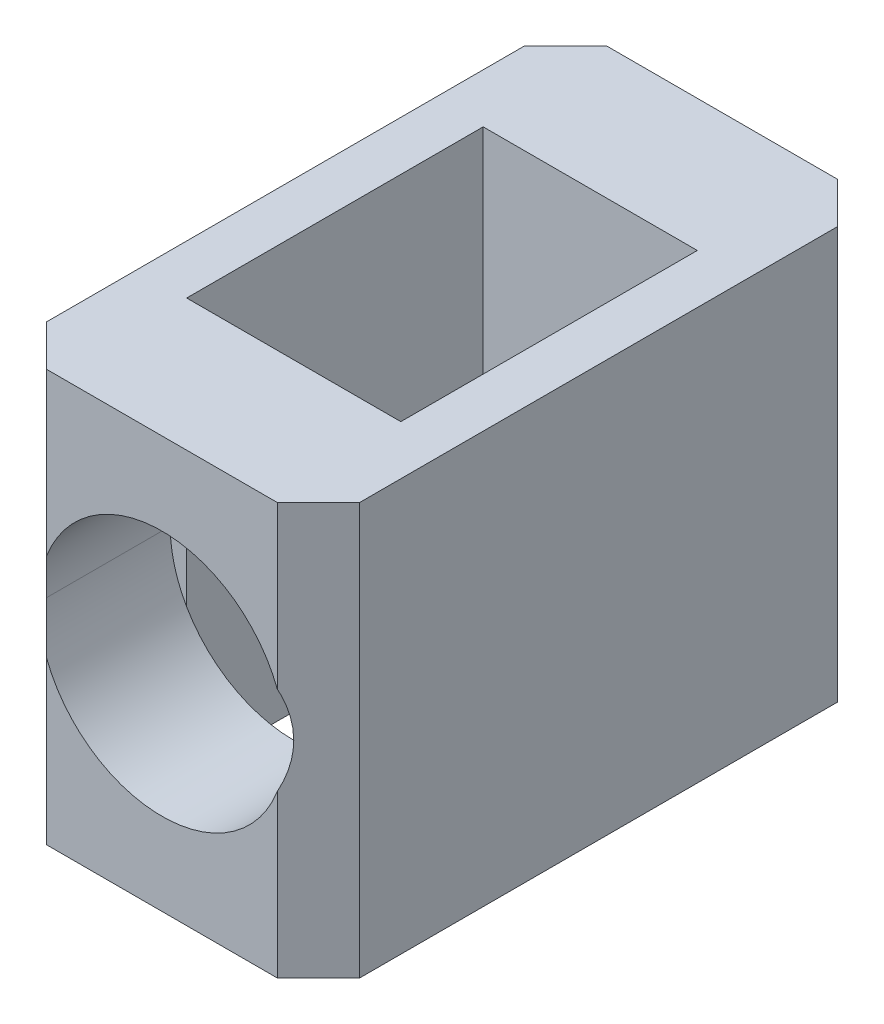
ISO-10303-21;
HEADER;
FILE_DESCRIPTION(('STEP AP214'),'2;1');
FILE_NAME('part.step','',(''),(''),'','','');
FILE_SCHEMA(('AUTOMOTIVE_DESIGN { 1 0 10303 214 1 1 1 1 }'));
ENDSEC;
DATA;
#1=APPLICATION_CONTEXT('core data for automotive mechanical design processes');
#2=APPLICATION_PROTOCOL_DEFINITION('international standard','automotive_design',2000,#1);
#3=PRODUCT_CONTEXT('',#1,'mechanical');
#4=PRODUCT('Part','Part','',(#3));
#5=PRODUCT_RELATED_PRODUCT_CATEGORY('part','',(#4));
#6=PRODUCT_DEFINITION_FORMATION('','',#4);
#7=PRODUCT_DEFINITION_CONTEXT('part definition',#1,'design');
#8=PRODUCT_DEFINITION('design','',#6,#7);
#9=PRODUCT_DEFINITION_SHAPE('','',#8);
#10=(LENGTH_UNIT() NAMED_UNIT(*) SI_UNIT(.MILLI.,.METRE.));
#11=(NAMED_UNIT(*) PLANE_ANGLE_UNIT() SI_UNIT($,.RADIAN.));
#12=(NAMED_UNIT(*) SI_UNIT($,.STERADIAN.) SOLID_ANGLE_UNIT());
#13=UNCERTAINTY_MEASURE_WITH_UNIT(LENGTH_MEASURE(1.E-05),#10,'distance_accuracy_value','');
#14=(GEOMETRIC_REPRESENTATION_CONTEXT(3) GLOBAL_UNCERTAINTY_ASSIGNED_CONTEXT((#13)) GLOBAL_UNIT_ASSIGNED_CONTEXT((#10,
#11,#12)) REPRESENTATION_CONTEXT('',''));
#15=CARTESIAN_POINT('',(0.,0.,0.));
#16=DIRECTION('',(0.,0.,1.));
#17=DIRECTION('',(1.,0.,0.));
#18=AXIS2_PLACEMENT_3D('',#15,#16,#17);
#19=CARTESIAN_POINT('',(7.61999999999975,5.27000000000021,8.43));
#20=DIRECTION('',(0.,0.,-1.));
#21=DIRECTION('',(-1.,0.,0.));
#22=AXIS2_PLACEMENT_3D('',#19,#20,#21);
#23=CYLINDRICAL_SURFACE('',#22,1.5);
#24=DIRECTION('',(0.,0.,1.));
#25=VECTOR('',#24,1.);
#26=CARTESIAN_POINT('',(6.12000000000035,5.26999999999963,8.43));
#27=LINE('',#26,#25);
#28=CARTESIAN_POINT('',(6.12000000000032,5.26999999999963,6.83));
#29=VERTEX_POINT('',#28);
#30=CARTESIAN_POINT('',(6.12000000000032,5.26999999999963,8.33));
#31=VERTEX_POINT('',#30);
#32=EDGE_CURVE('E264',#29,#31,#27,.T.);
#33=ORIENTED_EDGE('',*,*,#32,.F.);
#34=CARTESIAN_POINT('',(7.61999999999972,5.27000000000021,6.82999999999992));
#35=DIRECTION('',(0.,0.,1.));
#36=DIRECTION('',(-1.,0.,0.));
#37=AXIS2_PLACEMENT_3D('',#34,#35,#36);
#38=CIRCLE('',#37,1.5);
#39=CARTESIAN_POINT('',(6.32,6.01833147735468,6.83));
#40=VERTEX_POINT('',#39);
#41=EDGE_CURVE('E28',#40,#29,#38,.T.);
#42=ORIENTED_EDGE('',*,*,#41,.F.);
#43=CARTESIAN_POINT('',(7.61999999999972,5.27000000000021,6.83));
#44=DIRECTION('',(0.,0.,1.));
#45=DIRECTION('',(-1.,0.,0.));
#46=AXIS2_PLACEMENT_3D('',#43,#44,#45);
#47=CIRCLE('',#46,1.5);
#48=CARTESIAN_POINT('',(8.92,6.01833147735475,6.82999999999989));
#49=VERTEX_POINT('',#48);
#50=EDGE_CURVE('E347',#49,#40,#47,.T.);
#51=ORIENTED_EDGE('',*,*,#50,.F.);
#52=CARTESIAN_POINT('',(7.61999999999972,5.27000000000021,6.82999999999992));
#53=DIRECTION('',(0.,0.,1.));
#54=DIRECTION('',(-1.,0.,0.));
#55=AXIS2_PLACEMENT_3D('',#52,#53,#54);
#56=CIRCLE('',#55,1.5);
#57=CARTESIAN_POINT('',(9.11999999999983,5.27000000000007,6.82999999999989));
#58=VERTEX_POINT('',#57);
#59=EDGE_CURVE('E11',#58,#49,#56,.T.);
#60=ORIENTED_EDGE('',*,*,#59,.F.);
#61=DIRECTION('',(0.,0.,1.));
#62=VECTOR('',#61,1.);
#63=CARTESIAN_POINT('',(9.11999999999986,5.27000000000007,8.43));
#64=LINE('',#63,#62);
#65=CARTESIAN_POINT('',(9.11999999999983,5.27000000000007,8.32999999999989));
#66=VERTEX_POINT('',#65);
#67=EDGE_CURVE('E266',#58,#66,#64,.T.);
#68=ORIENTED_EDGE('',*,*,#67,.T.);
#69=CARTESIAN_POINT('',(7.61999999999975,5.27000000000021,9.83));
#70=DIRECTION('',(0.707106781186561,0.,0.707106781186534));
#71=DIRECTION('',(-0.707106781186534,0.,0.707106781186561));
#72=AXIS2_PLACEMENT_3D('',#69,#70,#71);
#73=ELLIPSE('',#72,2.12132034355964,1.5);
#74=CARTESIAN_POINT('',(9.01999999999981,5.80851648071365,8.43));
#75=VERTEX_POINT('',#74);
#76=EDGE_CURVE('E378',#66,#75,#73,.T.);
#77=ORIENTED_EDGE('',*,*,#76,.T.);
#78=CARTESIAN_POINT('',(7.61999999999975,5.27000000000021,8.43));
#79=DIRECTION('',(0.,0.,1.));
#80=DIRECTION('',(-1.,0.,0.));
#81=AXIS2_PLACEMENT_3D('',#78,#79,#80);
#82=CIRCLE('',#81,1.5);
#83=CARTESIAN_POINT('',(6.21999999999991,5.80851648071329,8.43));
#84=VERTEX_POINT('',#83);
#85=EDGE_CURVE('E351',#75,#84,#82,.T.);
#86=ORIENTED_EDGE('',*,*,#85,.T.);
#87=CARTESIAN_POINT('',(7.61999999999975,5.27000000000021,9.83));
#88=DIRECTION('',(-0.707106781186535,0.,0.70710678118656));
#89=DIRECTION('',(0.70710678118656,0.,0.707106781186535));
#90=AXIS2_PLACEMENT_3D('',#87,#88,#89);
#91=ELLIPSE('',#90,2.12132034355964,1.5);
#92=EDGE_CURVE('E269',#84,#31,#91,.T.);
#93=ORIENTED_EDGE('',*,*,#92,.T.);
#94=EDGE_LOOP('',(#33,#42,#51,#60,#68,#77,#86,#93));
#95=FACE_BOUND('',#94,.T.);
#96=ADVANCED_FACE('F17',(#95),#23,.F.);
#97=CARTESIAN_POINT('',(8.94500000000031,5.26999999999963,6.82999999999989));
#98=DIRECTION('',(0.,0.,1.));
#99=DIRECTION('',(1.,0.,0.));
#100=AXIS2_PLACEMENT_3D('',#97,#98,#99);
#101=PLANE('',#100);
#102=DIRECTION('',(0.,-1.,0.));
#103=VECTOR('',#102,1.);
#104=CARTESIAN_POINT('',(8.91999999999985,2.77000000000016,6.82999999999989));
#105=LINE('',#104,#103);
#106=CARTESIAN_POINT('',(8.92,4.52166852264494,6.82999999999989));
#107=VERTEX_POINT('',#106);
#108=EDGE_CURVE('E280',#49,#107,#105,.T.);
#109=ORIENTED_EDGE('',*,*,#108,.T.);
#110=CARTESIAN_POINT('',(7.61999999999972,5.27000000000021,6.82999999999992));
#111=DIRECTION('',(0.,0.,1.));
#112=DIRECTION('',(-1.,0.,0.));
#113=AXIS2_PLACEMENT_3D('',#110,#111,#112);
#114=CIRCLE('',#113,1.5);
#115=EDGE_CURVE('E297',#107,#58,#114,.T.);
#116=ORIENTED_EDGE('',*,*,#115,.T.);
#117=ORIENTED_EDGE('',*,*,#59,.T.);
#118=EDGE_LOOP('',(#109,#116,#117));
#119=FACE_BOUND('',#118,.T.);
#120=ADVANCED_FACE('F462',(#119),#101,.T.);
#121=CARTESIAN_POINT('',(8.94500000000031,5.26999999999963,6.82999999999989));
#122=DIRECTION('',(0.,0.,1.));
#123=DIRECTION('',(1.,0.,0.));
#124=AXIS2_PLACEMENT_3D('',#121,#122,#123);
#125=PLANE('',#124);
#126=CARTESIAN_POINT('',(7.61999999999972,5.27000000000021,6.82999999999992));
#127=DIRECTION('',(0.,0.,1.));
#128=DIRECTION('',(-1.,0.,0.));
#129=AXIS2_PLACEMENT_3D('',#126,#127,#128);
#130=CIRCLE('',#129,1.5);
#131=CARTESIAN_POINT('',(6.32000000000016,4.52166852264501,6.83));
#132=VERTEX_POINT('',#131);
#133=EDGE_CURVE('E267',#29,#132,#130,.T.);
#134=ORIENTED_EDGE('',*,*,#133,.T.);
#135=DIRECTION('',(0.,1.,0.));
#136=VECTOR('',#135,1.);
#137=CARTESIAN_POINT('',(6.31999999999988,2.77000000000016,6.83));
#138=LINE('',#137,#136);
#139=EDGE_CURVE('E352',#132,#40,#138,.T.);
#140=ORIENTED_EDGE('',*,*,#139,.T.);
#141=ORIENTED_EDGE('',*,*,#41,.T.);
#142=EDGE_LOOP('',(#134,#140,#141));
#143=FACE_BOUND('',#142,.T.);
#144=ADVANCED_FACE('F491',(#143),#125,.T.);
#145=CARTESIAN_POINT('',(7.61999999999975,5.27000000000021,8.43));
#146=DIRECTION('',(0.,0.,-1.));
#147=DIRECTION('',(-1.,0.,0.));
#148=AXIS2_PLACEMENT_3D('',#145,#146,#147);
#149=CYLINDRICAL_SURFACE('',#148,1.5);
#150=ORIENTED_EDGE('',*,*,#133,.F.);
#151=ORIENTED_EDGE('',*,*,#32,.T.);
#152=CARTESIAN_POINT('',(7.61999999999975,5.27000000000021,9.83));
#153=DIRECTION('',(-0.707106781186535,0.,0.70710678118656));
#154=DIRECTION('',(0.70710678118656,0.,0.707106781186535));
#155=AXIS2_PLACEMENT_3D('',#152,#153,#154);
#156=ELLIPSE('',#155,2.12132034355964,1.5);
#157=CARTESIAN_POINT('',(6.21999999999977,4.73148351928682,8.43));
#158=VERTEX_POINT('',#157);
#159=EDGE_CURVE('E274',#31,#158,#156,.T.);
#160=ORIENTED_EDGE('',*,*,#159,.T.);
#161=CARTESIAN_POINT('',(7.61999999999975,5.27000000000021,8.43));
#162=DIRECTION('',(0.,0.,1.));
#163=DIRECTION('',(-1.,0.,0.));
#164=AXIS2_PLACEMENT_3D('',#161,#162,#163);
#165=CIRCLE('',#164,1.5);
#166=CARTESIAN_POINT('',(9.02000000000015,4.73148351928624,8.43));
#167=VERTEX_POINT('',#166);
#168=EDGE_CURVE('E289',#158,#167,#165,.T.);
#169=ORIENTED_EDGE('',*,*,#168,.T.);
#170=CARTESIAN_POINT('',(7.61999999999975,5.27000000000021,9.83));
#171=DIRECTION('',(0.707106781186561,0.,0.707106781186534));
#172=DIRECTION('',(-0.707106781186534,0.,0.707106781186561));
#173=AXIS2_PLACEMENT_3D('',#170,#171,#172);
#174=ELLIPSE('',#173,2.12132034355964,1.5);
#175=EDGE_CURVE('E361',#167,#66,#174,.T.);
#176=ORIENTED_EDGE('',*,*,#175,.T.);
#177=ORIENTED_EDGE('',*,*,#67,.F.);
#178=ORIENTED_EDGE('',*,*,#115,.F.);
#179=CARTESIAN_POINT('',(7.61999999999972,5.27000000000021,6.83));
#180=DIRECTION('',(0.,0.,1.));
#181=DIRECTION('',(-1.,0.,0.));
#182=AXIS2_PLACEMENT_3D('',#179,#180,#181);
#183=CIRCLE('',#182,1.5);
#184=EDGE_CURVE('E273',#132,#107,#183,.T.);
#185=ORIENTED_EDGE('',*,*,#184,.F.);
#186=EDGE_LOOP('',(#150,#151,#160,#169,#176,#177,#178,#185));
#187=FACE_BOUND('',#186,.T.);
#188=ADVANCED_FACE('F19',(#187),#149,.F.);
#189=CARTESIAN_POINT('',(8.61999999999958,7.77000000000033,6.83));
#190=DIRECTION('',(0.,0.,1.));
#191=DIRECTION('',(1.,0.,0.));
#192=AXIS2_PLACEMENT_3D('',#189,#190,#191);
#193=PLANE('',#192);
#194=ORIENTED_EDGE('',*,*,#184,.T.);
#195=DIRECTION('',(0.,1.,0.));
#196=VECTOR('',#195,1.);
#197=CARTESIAN_POINT('',(8.91999999999985,2.77000000000016,6.83));
#198=LINE('',#197,#196);
#199=CARTESIAN_POINT('',(8.91999999999985,2.77000000000016,6.83));
#200=VERTEX_POINT('',#199);
#201=EDGE_CURVE('E322',#200,#107,#198,.T.);
#202=ORIENTED_EDGE('',*,*,#201,.F.);
#203=DIRECTION('',(1.,0.,0.));
#204=VECTOR('',#203,1.);
#205=CARTESIAN_POINT('',(65.5310968965142,2.7700000000002,6.82999999999898));
#206=LINE('',#205,#204);
#207=CARTESIAN_POINT('',(6.31999999999988,2.77000000000016,6.83));
#208=VERTEX_POINT('',#207);
#209=EDGE_CURVE('E90',#208,#200,#206,.T.);
#210=ORIENTED_EDGE('',*,*,#209,.F.);
#211=DIRECTION('',(0.,1.,0.));
#212=VECTOR('',#211,1.);
#213=CARTESIAN_POINT('',(6.31999999999988,2.77000000000016,6.83));
#214=LINE('',#213,#212);
#215=EDGE_CURVE('E285',#208,#132,#214,.T.);
#216=ORIENTED_EDGE('',*,*,#215,.T.);
#217=EDGE_LOOP('',(#194,#202,#210,#216));
#218=FACE_BOUND('',#217,.T.);
#219=ADVANCED_FACE('F455',(#218),#193,.F.);
#220=CARTESIAN_POINT('',(5.97000000000028,5.26999999999964,8.18));
#221=DIRECTION('',(-0.707106781186534,0.,0.707106781186561));
#222=DIRECTION('',(0.,1.,0.));
#223=AXIS2_PLACEMENT_3D('',#220,#221,#222);
#224=PLANE('',#223);
#225=DIRECTION('',(0.,1.,0.));
#226=VECTOR('',#225,1.);
#227=CARTESIAN_POINT('',(5.72,5.26999999999984,7.93));
#228=LINE('',#227,#226);
#229=CARTESIAN_POINT('',(5.71999999999977,2.77000000000016,7.93));
#230=VERTEX_POINT('',#229);
#231=CARTESIAN_POINT('',(5.72000000000028,7.76999999999961,7.93));
#232=VERTEX_POINT('',#231);
#233=EDGE_CURVE('E260',#230,#232,#228,.T.);
#234=ORIENTED_EDGE('',*,*,#233,.F.);
#235=DIRECTION('',(-0.70710678118656,0.,-0.707106781186535));
#236=VECTOR('',#235,1.);
#237=CARTESIAN_POINT('',(-57.000076808694,2.76999999999905,-54.7900768086914));
#238=LINE('',#237,#236);
#239=CARTESIAN_POINT('',(6.22000000000034,2.76999999999965,8.43));
#240=VERTEX_POINT('',#239);
#241=EDGE_CURVE('E295',#240,#230,#238,.T.);
#242=ORIENTED_EDGE('',*,*,#241,.F.);
#243=DIRECTION('',(0.,1.,0.));
#244=VECTOR('',#243,1.);
#245=CARTESIAN_POINT('',(6.21999999999983,5.27000000000006,8.43));
#246=LINE('',#245,#244);
#247=EDGE_CURVE('E286',#240,#158,#246,.T.);
#248=ORIENTED_EDGE('',*,*,#247,.T.);
#249=ORIENTED_EDGE('',*,*,#159,.F.);
#250=ORIENTED_EDGE('',*,*,#92,.F.);
#251=DIRECTION('',(0.,1.,0.));
#252=VECTOR('',#251,1.);
#253=CARTESIAN_POINT('',(6.21999999999983,5.27000000000006,8.43));
#254=LINE('',#253,#252);
#255=CARTESIAN_POINT('',(6.22000000000011,7.76999999999983,8.43));
#256=VERTEX_POINT('',#255);
#257=EDGE_CURVE('E376',#84,#256,#254,.T.);
#258=ORIENTED_EDGE('',*,*,#257,.T.);
#259=DIRECTION('',(-0.70710678118656,0.,-0.707106781186535));
#260=VECTOR('',#259,1.);
#261=CARTESIAN_POINT('',(-57.0000768086941,7.76999999999941,-54.7900768086914));
#262=LINE('',#261,#260);
#263=EDGE_CURVE('E314',#256,#232,#262,.T.);
#264=ORIENTED_EDGE('',*,*,#263,.T.);
#265=EDGE_LOOP('',(#234,#242,#248,#249,#250,#258,#264));
#266=FACE_BOUND('',#265,.T.);
#267=ADVANCED_FACE('F415',(#266),#224,.T.);
#268=CARTESIAN_POINT('',(9.26999999999987,5.27,8.18));
#269=DIRECTION('',(0.70710678118656,0.,0.707106781186535));
#270=DIRECTION('',(0.,-1.,0.));
#271=AXIS2_PLACEMENT_3D('',#268,#269,#270);
#272=PLANE('',#271);
#273=DIRECTION('',(0.,-1.,0.));
#274=VECTOR('',#273,1.);
#275=CARTESIAN_POINT('',(9.52000000000015,5.26999999999985,7.93));
#276=LINE('',#275,#274);
#277=CARTESIAN_POINT('',(9.51999999999967,7.77000000000023,7.93));
#278=VERTEX_POINT('',#277);
#279=CARTESIAN_POINT('',(9.51999999999987,2.77000000000009,7.93));
#280=VERTEX_POINT('',#279);
#281=EDGE_CURVE('E216',#278,#280,#276,.T.);
#282=ORIENTED_EDGE('',*,*,#281,.F.);
#283=DIRECTION('',(-0.707106781186534,0.,0.707106781186561));
#284=VECTOR('',#283,1.);
#285=CARTESIAN_POINT('',(72.2400768086914,7.77000000000049,-54.7900768086937));
#286=LINE('',#285,#284);
#287=CARTESIAN_POINT('',(9.01999999999987,7.77,8.43));
#288=VERTEX_POINT('',#287);
#289=EDGE_CURVE('E293',#278,#288,#286,.T.);
#290=ORIENTED_EDGE('',*,*,#289,.T.);
#291=DIRECTION('',(0.,-1.,0.));
#292=VECTOR('',#291,1.);
#293=CARTESIAN_POINT('',(9.02000000000035,5.26999999999964,8.43));
#294=LINE('',#293,#292);
#295=EDGE_CURVE('E372',#288,#75,#294,.T.);
#296=ORIENTED_EDGE('',*,*,#295,.T.);
#297=ORIENTED_EDGE('',*,*,#76,.F.);
#298=ORIENTED_EDGE('',*,*,#175,.F.);
#299=DIRECTION('',(0.,-1.,0.));
#300=VECTOR('',#299,1.);
#301=CARTESIAN_POINT('',(9.02000000000035,5.26999999999964,8.43));
#302=LINE('',#301,#300);
#303=CARTESIAN_POINT('',(9.0200000000001,2.76999999999987,8.43));
#304=VERTEX_POINT('',#303);
#305=EDGE_CURVE('E328',#167,#304,#302,.T.);
#306=ORIENTED_EDGE('',*,*,#305,.T.);
#307=DIRECTION('',(-0.707106781186534,0.,0.707106781186561));
#308=VECTOR('',#307,1.);
#309=CARTESIAN_POINT('',(72.2400768086915,2.77000000000048,-54.7900768086937));
#310=LINE('',#309,#308);
#311=EDGE_CURVE('E184',#280,#304,#310,.T.);
#312=ORIENTED_EDGE('',*,*,#311,.F.);
#313=EDGE_LOOP('',(#282,#290,#296,#297,#298,#306,#312));
#314=FACE_BOUND('',#313,.T.);
#315=ADVANCED_FACE('F432',(#314),#272,.T.);
#316=CARTESIAN_POINT('',(5.97000000000017,5.26999999999964,1.87999999999996));
#317=DIRECTION('',(-0.70710678118656,0.,-0.707106781186535));
#318=DIRECTION('',(-0.707106781186535,0.,0.70710678118656));
#319=AXIS2_PLACEMENT_3D('',#316,#317,#318);
#320=PLANE('',#319);
#321=DIRECTION('',(0.,-1.,0.));
#322=VECTOR('',#321,1.);
#323=CARTESIAN_POINT('',(5.71999999999991,5.26999999999984,2.12999999999996));
#324=LINE('',#323,#322);
#325=CARTESIAN_POINT('',(5.7200000000002,7.76999999999961,2.13000000000006));
#326=VERTEX_POINT('',#325);
#327=CARTESIAN_POINT('',(5.71999999999969,2.77000000000016,2.13000000000006));
#328=VERTEX_POINT('',#327);
#329=EDGE_CURVE('E230',#326,#328,#324,.T.);
#330=ORIENTED_EDGE('',*,*,#329,.F.);
#331=DIRECTION('',(0.707106781186534,0.,-0.707106781186561));
#332=VECTOR('',#331,1.);
#333=CARTESIAN_POINT('',(62.6400768086915,7.77000000000034,-54.7900768086936));
#334=LINE('',#333,#332);
#335=CARTESIAN_POINT('',(6.22,7.76999999999983,1.63000000000004));
#336=VERTEX_POINT('',#335);
#337=EDGE_CURVE('E346',#326,#336,#334,.T.);
#338=ORIENTED_EDGE('',*,*,#337,.T.);
#339=DIRECTION('',(0.,-1.,0.));
#340=VECTOR('',#339,1.);
#341=CARTESIAN_POINT('',(6.21999999999969,5.27000000000006,1.62999999999994));
#342=LINE('',#341,#340);
#343=CARTESIAN_POINT('',(6.2200000000002,2.76999999999965,1.63000000000004));
#344=VERTEX_POINT('',#343);
#345=EDGE_CURVE('E325',#336,#344,#342,.T.);
#346=ORIENTED_EDGE('',*,*,#345,.T.);
#347=DIRECTION('',(0.707106781186534,0.,-0.707106781186561));
#348=VECTOR('',#347,1.);
#349=CARTESIAN_POINT('',(62.6400768086917,2.77000000000019,-54.7900768086936));
#350=LINE('',#349,#348);
#351=EDGE_CURVE('E202',#328,#344,#350,.T.);
#352=ORIENTED_EDGE('',*,*,#351,.F.);
#353=EDGE_LOOP('',(#330,#338,#346,#352));
#354=FACE_BOUND('',#353,.T.);
#355=ADVANCED_FACE('F423',(#354),#320,.T.);
#356=CARTESIAN_POINT('',(9.26999999999975,5.27,1.87999999999989));
#357=DIRECTION('',(0.707106781186535,0.,-0.707106781186561));
#358=DIRECTION('',(0.,-1.,0.));
#359=AXIS2_PLACEMENT_3D('',#356,#357,#358);
#360=PLANE('',#359);
#361=DIRECTION('',(0.,-1.,0.));
#362=VECTOR('',#361,1.);
#363=CARTESIAN_POINT('',(9.02000000000021,5.26999999999964,1.6299999999999));
#364=LINE('',#363,#362);
#365=CARTESIAN_POINT('',(9.01999999999973,7.77,1.63));
#366=VERTEX_POINT('',#365);
#367=CARTESIAN_POINT('',(9.02,2.76999999999987,1.63));
#368=VERTEX_POINT('',#367);
#369=EDGE_CURVE('E308',#366,#368,#364,.T.);
#370=ORIENTED_EDGE('',*,*,#369,.F.);
#371=DIRECTION('',(0.70710678118656,0.,0.707106781186535));
#372=VECTOR('',#371,1.);
#373=CARTESIAN_POINT('',(-47.4000768086939,7.76999999999941,-54.7900768086916));
#374=LINE('',#373,#372);
#375=CARTESIAN_POINT('',(9.51999999999958,7.77000000000023,2.13));
#376=VERTEX_POINT('',#375);
#377=EDGE_CURVE('E208',#366,#376,#374,.T.);
#378=ORIENTED_EDGE('',*,*,#377,.T.);
#379=DIRECTION('',(0.,-1.,0.));
#380=VECTOR('',#379,1.);
#381=CARTESIAN_POINT('',(9.52,5.26999999999985,2.12999999999989));
#382=LINE('',#381,#380);
#383=CARTESIAN_POINT('',(9.51999999999978,2.77000000000009,2.13));
#384=VERTEX_POINT('',#383);
#385=EDGE_CURVE('E205',#376,#384,#382,.T.);
#386=ORIENTED_EDGE('',*,*,#385,.T.);
#387=DIRECTION('',(0.70710678118656,0.,0.707106781186535));
#388=VECTOR('',#387,1.);
#389=CARTESIAN_POINT('',(-47.4000768086939,2.76999999999905,-54.7900768086916));
#390=LINE('',#389,#388);
#391=EDGE_CURVE('E191',#368,#384,#390,.T.);
#392=ORIENTED_EDGE('',*,*,#391,.F.);
#393=EDGE_LOOP('',(#370,#378,#386,#392));
#394=FACE_BOUND('',#393,.T.);
#395=ADVANCED_FACE('F206',(#394),#360,.T.);
#396=CARTESIAN_POINT('',(65.531096896513,2.77000000000019,-54.7900768086936));
#397=DIRECTION('',(0.,1.,0.));
#398=DIRECTION('',(1.,0.,0.));
#399=AXIS2_PLACEMENT_3D('',#396,#397,#398);
#400=PLANE('',#399);
#401=DIRECTION('',(0.,0.,1.));
#402=VECTOR('',#401,1.);
#403=CARTESIAN_POINT('',(6.31999999999877,2.77000000000015,-54.7900768086926));
#404=LINE('',#403,#402);
#405=CARTESIAN_POINT('',(6.3199999999998,2.77000000000016,3.22999999999994));
#406=VERTEX_POINT('',#405);
#407=EDGE_CURVE('E281',#406,#208,#404,.T.);
#408=ORIENTED_EDGE('',*,*,#407,.T.);
#409=ORIENTED_EDGE('',*,*,#209,.T.);
#410=DIRECTION('',(0.,0.,-1.));
#411=VECTOR('',#410,1.);
#412=CARTESIAN_POINT('',(8.91999999999874,2.77000000000015,-54.7900768086926));
#413=LINE('',#412,#411);
#414=CARTESIAN_POINT('',(8.91999999999976,2.77000000000016,3.22999999999989));
#415=VERTEX_POINT('',#414);
#416=EDGE_CURVE('E284',#200,#415,#413,.T.);
#417=ORIENTED_EDGE('',*,*,#416,.T.);
#418=DIRECTION('',(-1.,0.,0.));
#419=VECTOR('',#418,1.);
#420=CARTESIAN_POINT('',(65.5310968965141,2.7700000000002,3.22999999999887));
#421=LINE('',#420,#419);
#422=EDGE_CURVE('E238',#415,#406,#421,.T.);
#423=ORIENTED_EDGE('',*,*,#422,.T.);
#424=EDGE_LOOP('',(#408,#409,#417,#423));
#425=FACE_BOUND('',#424,.T.);
#426=DIRECTION('',(0.,0.,-1.));
#427=VECTOR('',#426,1.);
#428=CARTESIAN_POINT('',(9.51999999999876,2.77000000000008,-54.7900768086926));
#429=LINE('',#428,#427);
#430=EDGE_CURVE('E195',#280,#384,#429,.T.);
#431=ORIENTED_EDGE('',*,*,#430,.F.);
#432=ORIENTED_EDGE('',*,*,#311,.T.);
#433=DIRECTION('',(-1.,0.,0.));
#434=VECTOR('',#433,1.);
#435=CARTESIAN_POINT('',(65.5310968965142,2.7700000000002,8.42999999999897));
#436=LINE('',#435,#434);
#437=EDGE_CURVE('E224',#304,#240,#436,.T.);
#438=ORIENTED_EDGE('',*,*,#437,.T.);
#439=ORIENTED_EDGE('',*,*,#241,.T.);
#440=DIRECTION('',(0.,0.,-1.));
#441=VECTOR('',#440,1.);
#442=CARTESIAN_POINT('',(5.71999999999866,2.77000000000016,-54.7900768086925));
#443=LINE('',#442,#441);
#444=EDGE_CURVE('E233',#230,#328,#443,.T.);
#445=ORIENTED_EDGE('',*,*,#444,.T.);
#446=ORIENTED_EDGE('',*,*,#351,.T.);
#447=DIRECTION('',(-1.,0.,0.));
#448=VECTOR('',#447,1.);
#449=CARTESIAN_POINT('',(65.5310968965141,2.7700000000002,1.62999999999888));
#450=LINE('',#449,#448);
#451=EDGE_CURVE('E198',#368,#344,#450,.T.);
#452=ORIENTED_EDGE('',*,*,#451,.F.);
#453=ORIENTED_EDGE('',*,*,#391,.T.);
#454=EDGE_LOOP('',(#431,#432,#438,#439,#445,#446,#452,#453));
#455=FACE_BOUND('',#454,.T.);
#456=ADVANCED_FACE('F193',(#425,#455),#400,.F.);
#457=CARTESIAN_POINT('',(8.82000000000031,2.76999999999965,8.43));
#458=DIRECTION('',(0.,0.,1.));
#459=DIRECTION('',(1.,0.,0.));
#460=AXIS2_PLACEMENT_3D('',#457,#458,#459);
#461=PLANE('',#460);
#462=ORIENTED_EDGE('',*,*,#85,.F.);
#463=ORIENTED_EDGE('',*,*,#295,.F.);
#464=DIRECTION('',(-1.,0.,0.));
#465=VECTOR('',#464,1.);
#466=CARTESIAN_POINT('',(65.531096896514,7.77000000000035,8.42999999999897));
#467=LINE('',#466,#465);
#468=EDGE_CURVE('E303',#288,#256,#467,.T.);
#469=ORIENTED_EDGE('',*,*,#468,.T.);
#470=ORIENTED_EDGE('',*,*,#257,.F.);
#471=EDGE_LOOP('',(#462,#463,#469,#470));
#472=FACE_BOUND('',#471,.T.);
#473=ADVANCED_FACE('F437',(#472),#461,.T.);
#474=CARTESIAN_POINT('',(8.61999999999958,7.77000000000033,6.83));
#475=DIRECTION('',(0.,0.,1.));
#476=DIRECTION('',(1.,0.,0.));
#477=AXIS2_PLACEMENT_3D('',#474,#475,#476);
#478=PLANE('',#477);
#479=DIRECTION('',(0.,1.,0.));
#480=VECTOR('',#479,1.);
#481=CARTESIAN_POINT('',(8.91999999999985,2.77000000000016,6.83));
#482=LINE('',#481,#480);
#483=CARTESIAN_POINT('',(8.91999999999962,7.77000000000031,6.83));
#484=VERTEX_POINT('',#483);
#485=EDGE_CURVE('E275',#49,#484,#482,.T.);
#486=ORIENTED_EDGE('',*,*,#485,.F.);
#487=ORIENTED_EDGE('',*,*,#50,.T.);
#488=DIRECTION('',(0.,1.,0.));
#489=VECTOR('',#488,1.);
#490=CARTESIAN_POINT('',(6.31999999999988,2.77000000000016,6.83));
#491=LINE('',#490,#489);
#492=CARTESIAN_POINT('',(6.31999999999965,7.77000000000031,6.83));
#493=VERTEX_POINT('',#492);
#494=EDGE_CURVE('E228',#40,#493,#491,.T.);
#495=ORIENTED_EDGE('',*,*,#494,.T.);
#496=DIRECTION('',(1.,0.,0.));
#497=VECTOR('',#496,1.);
#498=CARTESIAN_POINT('',(65.5310968965139,7.77000000000035,6.82999999999898));
#499=LINE('',#498,#497);
#500=EDGE_CURVE('E258',#493,#484,#499,.T.);
#501=ORIENTED_EDGE('',*,*,#500,.T.);
#502=EDGE_LOOP('',(#486,#487,#495,#501));
#503=FACE_BOUND('',#502,.T.);
#504=ADVANCED_FACE('F467',(#503),#478,.F.);
#505=CARTESIAN_POINT('',(6.42,2.76999999999987,1.62999999999994));
#506=DIRECTION('',(0.,0.,-1.));
#507=DIRECTION('',(-1.,0.,0.));
#508=AXIS2_PLACEMENT_3D('',#505,#506,#507);
#509=PLANE('',#508);
#510=ORIENTED_EDGE('',*,*,#369,.T.);
#511=ORIENTED_EDGE('',*,*,#451,.T.);
#512=ORIENTED_EDGE('',*,*,#345,.F.);
#513=DIRECTION('',(-1.,0.,0.));
#514=VECTOR('',#513,1.);
#515=CARTESIAN_POINT('',(65.5310968965138,7.77000000000035,1.62999999999888));
#516=LINE('',#515,#514);
#517=EDGE_CURVE('E21',#366,#336,#516,.T.);
#518=ORIENTED_EDGE('',*,*,#517,.F.);
#519=EDGE_LOOP('',(#510,#511,#512,#518));
#520=FACE_BOUND('',#519,.T.);
#521=ADVANCED_FACE('F428',(#520),#509,.T.);
#522=CARTESIAN_POINT('',(6.61164106708944,7.76999999999981,7.62205114905214));
#523=DIRECTION('',(0.,1.,0.));
#524=DIRECTION('',(1.,0.,0.));
#525=AXIS2_PLACEMENT_3D('',#522,#523,#524);
#526=PLANE('',#525);
#527=DIRECTION('',(-1.,0.,0.));
#528=VECTOR('',#527,1.);
#529=CARTESIAN_POINT('',(65.5310968965139,7.77000000000035,3.22999999999887));
#530=LINE('',#529,#528);
#531=CARTESIAN_POINT('',(8.91999999999953,7.77000000000031,3.22999999999989));
#532=VERTEX_POINT('',#531);
#533=CARTESIAN_POINT('',(6.31999999999957,7.77000000000031,3.22999999999994));
#534=VERTEX_POINT('',#533);
#535=EDGE_CURVE('E254',#532,#534,#530,.T.);
#536=ORIENTED_EDGE('',*,*,#535,.F.);
#537=DIRECTION('',(0.,0.,-1.));
#538=VECTOR('',#537,1.);
#539=CARTESIAN_POINT('',(8.91999999999851,7.7700000000003,-54.7900768086926));
#540=LINE('',#539,#538);
#541=EDGE_CURVE('E279',#484,#532,#540,.T.);
#542=ORIENTED_EDGE('',*,*,#541,.F.);
#543=ORIENTED_EDGE('',*,*,#500,.F.);
#544=DIRECTION('',(0.,0.,1.));
#545=VECTOR('',#544,1.);
#546=CARTESIAN_POINT('',(6.31999999999854,7.7700000000003,-54.7900768086926));
#547=LINE('',#546,#545);
#548=EDGE_CURVE('E307',#534,#493,#547,.T.);
#549=ORIENTED_EDGE('',*,*,#548,.F.);
#550=EDGE_LOOP('',(#536,#542,#543,#549));
#551=FACE_BOUND('',#550,.T.);
#552=ORIENTED_EDGE('',*,*,#517,.T.);
#553=ORIENTED_EDGE('',*,*,#337,.F.);
#554=DIRECTION('',(0.,0.,-1.));
#555=VECTOR('',#554,1.);
#556=CARTESIAN_POINT('',(5.71999999999918,7.7699999999996,-54.7900768086925));
#557=LINE('',#556,#555);
#558=EDGE_CURVE('E234',#232,#326,#557,.T.);
#559=ORIENTED_EDGE('',*,*,#558,.F.);
#560=ORIENTED_EDGE('',*,*,#263,.F.);
#561=ORIENTED_EDGE('',*,*,#468,.F.);
#562=ORIENTED_EDGE('',*,*,#289,.F.);
#563=DIRECTION('',(0.,0.,-1.));
#564=VECTOR('',#563,1.);
#565=CARTESIAN_POINT('',(9.51999999999856,7.77000000000022,-54.7900768086926));
#566=LINE('',#565,#564);
#567=EDGE_CURVE('E213',#278,#376,#566,.T.);
#568=ORIENTED_EDGE('',*,*,#567,.T.);
#569=ORIENTED_EDGE('',*,*,#377,.F.);
#570=EDGE_LOOP('',(#552,#553,#559,#560,#561,#562,#568,#569));
#571=FACE_BOUND('',#570,.T.);
#572=ADVANCED_FACE('F430',(#551,#571),#526,.T.);
#573=CARTESIAN_POINT('',(9.51999999999978,2.77000000000009,2.33));
#574=DIRECTION('',(1.,0.,0.));
#575=DIRECTION('',(0.,0.,-1.));
#576=AXIS2_PLACEMENT_3D('',#573,#574,#575);
#577=PLANE('',#576);
#578=ORIENTED_EDGE('',*,*,#281,.T.);
#579=ORIENTED_EDGE('',*,*,#430,.T.);
#580=ORIENTED_EDGE('',*,*,#385,.F.);
#581=ORIENTED_EDGE('',*,*,#567,.F.);
#582=EDGE_LOOP('',(#578,#579,#580,#581));
#583=FACE_BOUND('',#582,.T.);
#584=ADVANCED_FACE('F215',(#583),#577,.T.);
#585=CARTESIAN_POINT('',(8.82000000000031,2.76999999999965,8.43));
#586=DIRECTION('',(0.,0.,1.));
#587=DIRECTION('',(1.,0.,0.));
#588=AXIS2_PLACEMENT_3D('',#585,#586,#587);
#589=PLANE('',#588);
#590=ORIENTED_EDGE('',*,*,#305,.F.);
#591=ORIENTED_EDGE('',*,*,#168,.F.);
#592=ORIENTED_EDGE('',*,*,#247,.F.);
#593=ORIENTED_EDGE('',*,*,#437,.F.);
#594=EDGE_LOOP('',(#590,#591,#592,#593));
#595=FACE_BOUND('',#594,.T.);
#596=ADVANCED_FACE('F411',(#595),#589,.T.);
#597=CARTESIAN_POINT('',(8.91999999999953,7.77000000000031,3.53));
#598=DIRECTION('',(1.,0.,0.));
#599=DIRECTION('',(0.,0.,-1.));
#600=AXIS2_PLACEMENT_3D('',#597,#598,#599);
#601=PLANE('',#600);
#602=DIRECTION('',(0.,1.,0.));
#603=VECTOR('',#602,1.);
#604=CARTESIAN_POINT('',(8.91999999999976,2.77000000000016,3.22999999999989));
#605=LINE('',#604,#603);
#606=EDGE_CURVE('E246',#415,#532,#605,.T.);
#607=ORIENTED_EDGE('',*,*,#606,.F.);
#608=ORIENTED_EDGE('',*,*,#416,.F.);
#609=ORIENTED_EDGE('',*,*,#201,.T.);
#610=ORIENTED_EDGE('',*,*,#108,.F.);
#611=ORIENTED_EDGE('',*,*,#485,.T.);
#612=ORIENTED_EDGE('',*,*,#541,.T.);
#613=EDGE_LOOP('',(#607,#608,#609,#610,#611,#612));
#614=FACE_BOUND('',#613,.T.);
#615=ADVANCED_FACE('F454',(#614),#601,.F.);
#616=CARTESIAN_POINT('',(6.31999999999957,7.77000000000031,3.53));
#617=DIRECTION('',(-1.,0.,0.));
#618=DIRECTION('',(0.,1.,0.));
#619=AXIS2_PLACEMENT_3D('',#616,#617,#618);
#620=PLANE('',#619);
#621=ORIENTED_EDGE('',*,*,#548,.T.);
#622=ORIENTED_EDGE('',*,*,#494,.F.);
#623=ORIENTED_EDGE('',*,*,#139,.F.);
#624=ORIENTED_EDGE('',*,*,#215,.F.);
#625=ORIENTED_EDGE('',*,*,#407,.F.);
#626=DIRECTION('',(0.,1.,0.));
#627=VECTOR('',#626,1.);
#628=CARTESIAN_POINT('',(6.3199999999998,2.77000000000016,3.22999999999994));
#629=LINE('',#628,#627);
#630=EDGE_CURVE('E235',#406,#534,#629,.T.);
#631=ORIENTED_EDGE('',*,*,#630,.T.);
#632=EDGE_LOOP('',(#621,#622,#623,#624,#625,#631));
#633=FACE_BOUND('',#632,.T.);
#634=ADVANCED_FACE('F480',(#633),#620,.F.);
#635=CARTESIAN_POINT('',(5.71999999999977,2.77000000000016,7.73));
#636=DIRECTION('',(-1.,0.,0.));
#637=DIRECTION('',(0.,1.,0.));
#638=AXIS2_PLACEMENT_3D('',#635,#636,#637);
#639=PLANE('',#638);
#640=ORIENTED_EDGE('',*,*,#233,.T.);
#641=ORIENTED_EDGE('',*,*,#558,.T.);
#642=ORIENTED_EDGE('',*,*,#329,.T.);
#643=ORIENTED_EDGE('',*,*,#444,.F.);
#644=EDGE_LOOP('',(#640,#641,#642,#643));
#645=FACE_BOUND('',#644,.T.);
#646=ADVANCED_FACE('F419',(#645),#639,.T.);
#647=CARTESIAN_POINT('',(6.61999999999955,7.77000000000026,3.22999999999994));
#648=DIRECTION('',(0.,0.,-1.));
#649=DIRECTION('',(-1.,0.,0.));
#650=AXIS2_PLACEMENT_3D('',#647,#648,#649);
#651=PLANE('',#650);
#652=ORIENTED_EDGE('',*,*,#630,.F.);
#653=ORIENTED_EDGE('',*,*,#422,.F.);
#654=ORIENTED_EDGE('',*,*,#606,.T.);
#655=ORIENTED_EDGE('',*,*,#535,.T.);
#656=EDGE_LOOP('',(#652,#653,#654,#655));
#657=FACE_BOUND('',#656,.T.);
#658=ADVANCED_FACE('F472',(#657),#651,.F.);
#659=CLOSED_SHELL('',(#96,#120,#144,#188,#219,#267,#315,#355,#395,#456,#473,#504,#521,#572,#584,
#596,#615,#634,#646,#658));
#660=MANIFOLD_SOLID_BREP('B1',#659);
#661=ADVANCED_BREP_SHAPE_REPRESENTATION('',(#18,#660),#14);
#662=SHAPE_DEFINITION_REPRESENTATION(#9,#661);
ENDSEC;
END-ISO-10303-21;
